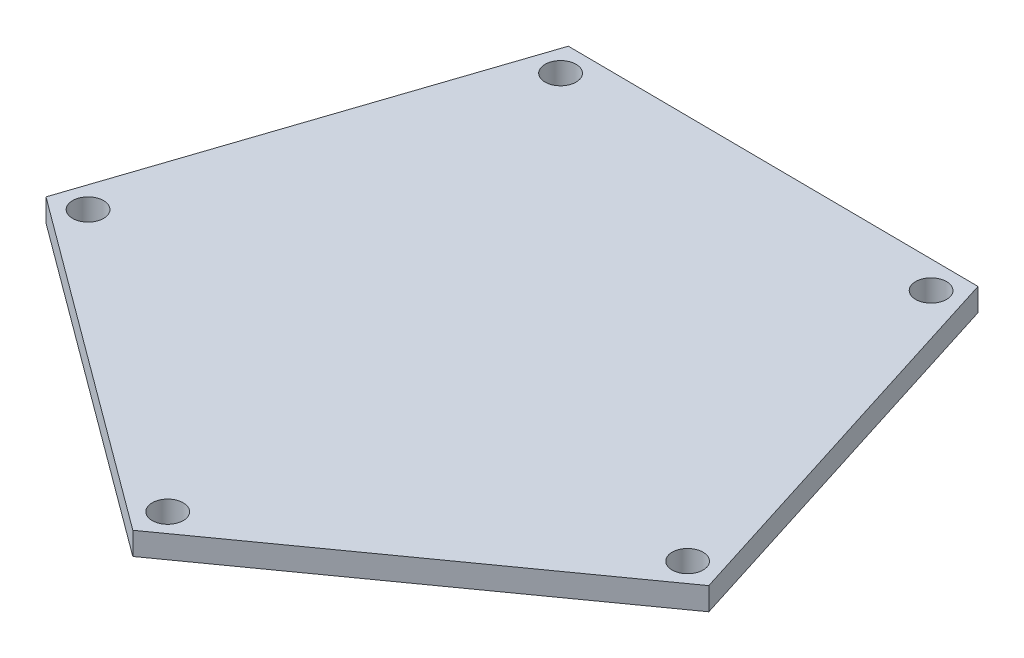
ISO-10303-21;
HEADER;
FILE_DESCRIPTION(('STEP AP214'),'2;1');
FILE_NAME('part.step','',(''),(''),'','','');
FILE_SCHEMA(('AUTOMOTIVE_DESIGN { 1 0 10303 214 1 1 1 1 }'));
ENDSEC;
DATA;
#1=APPLICATION_CONTEXT('core data for automotive mechanical design processes');
#2=APPLICATION_PROTOCOL_DEFINITION('international standard','automotive_design',2000,#1);
#3=PRODUCT_CONTEXT('',#1,'mechanical');
#4=PRODUCT('Part','Part','',(#3));
#5=PRODUCT_RELATED_PRODUCT_CATEGORY('part','',(#4));
#6=PRODUCT_DEFINITION_FORMATION('','',#4);
#7=PRODUCT_DEFINITION_CONTEXT('part definition',#1,'design');
#8=PRODUCT_DEFINITION('design','',#6,#7);
#9=PRODUCT_DEFINITION_SHAPE('','',#8);
#10=(LENGTH_UNIT() NAMED_UNIT(*) SI_UNIT(.MILLI.,.METRE.));
#11=(NAMED_UNIT(*) PLANE_ANGLE_UNIT() SI_UNIT($,.RADIAN.));
#12=(NAMED_UNIT(*) SI_UNIT($,.STERADIAN.) SOLID_ANGLE_UNIT());
#13=UNCERTAINTY_MEASURE_WITH_UNIT(LENGTH_MEASURE(1.E-05),#10,'distance_accuracy_value','');
#14=(GEOMETRIC_REPRESENTATION_CONTEXT(3) GLOBAL_UNCERTAINTY_ASSIGNED_CONTEXT((#13)) GLOBAL_UNIT_ASSIGNED_CONTEXT((#10,
#11,#12)) REPRESENTATION_CONTEXT('',''));
#15=CARTESIAN_POINT('',(0.,0.,0.));
#16=DIRECTION('',(0.,0.,1.));
#17=DIRECTION('',(1.,0.,0.));
#18=AXIS2_PLACEMENT_3D('',#15,#16,#17);
#19=CARTESIAN_POINT('',(0.,11.,0.));
#20=DIRECTION('',(0.,1.,0.));
#21=DIRECTION('',(0.,0.,1.));
#22=AXIS2_PLACEMENT_3D('',#19,#20,#21);
#23=PLANE('',#22);
#24=CARTESIAN_POINT('',(145.974464026982,11.,48.7010856094019));
#25=DIRECTION('',(0.,1.,0.));
#26=DIRECTION('',(0.,0.,1.));
#27=AXIS2_PLACEMENT_3D('',#24,#25,#26);
#28=CIRCLE('',#27,7.50000000000001);
#29=CARTESIAN_POINT('',(145.974464026982,11.,56.2010856094019));
#30=VERTEX_POINT('',#29);
#31=EDGE_CURVE('E179',#30,#30,#28,.T.);
#32=ORIENTED_EDGE('',*,*,#31,.F.);
#33=EDGE_LOOP('',(#32));
#34=FACE_BOUND('',#33,.T.);
#35=CARTESIAN_POINT('',(-146.717669584083,11.,46.4140615461807));
#36=DIRECTION('',(0.,1.,0.));
#37=DIRECTION('',(0.,0.,1.));
#38=AXIS2_PLACEMENT_3D('',#35,#36,#37);
#39=CIRCLE('',#38,7.50000000000001);
#40=CARTESIAN_POINT('',(-146.717669584083,11.,53.9140615461807));
#41=VERTEX_POINT('',#40);
#42=EDGE_CURVE('E191',#41,#41,#39,.T.);
#43=ORIENTED_EDGE('',*,*,#42,.F.);
#44=EDGE_LOOP('',(#43));
#45=FACE_BOUND('',#44,.T.);
#46=DIRECTION('',(0.813609596675983,0.,-0.581411579001265));
#47=VECTOR('',#46,1.);
#48=CARTESIAN_POINT('',(-1.33652109860429,11.,170.124911818793));
#49=LINE('',#48,#47);
#50=CARTESIAN_POINT('',(-1.33652109860429,11.,170.124911818793));
#51=VERTEX_POINT('',#50);
#52=CARTESIAN_POINT('',(161.385398236592,11.,53.84259601854));
#53=VERTEX_POINT('',#52);
#54=EDGE_CURVE('E120',#51,#53,#49,.T.);
#55=ORIENTED_EDGE('',*,*,#54,.T.);
#56=DIRECTION('',(-0.301536078699183,0.,-0.953454767276729));
#57=VECTOR('',#56,1.);
#58=CARTESIAN_POINT('',(161.385398236592,11.,53.84259601854));
#59=LINE('',#58,#57);
#60=CARTESIAN_POINT('',(101.078182496756,11.,-136.848357436806));
#61=VERTEX_POINT('',#60);
#62=EDGE_CURVE('E87',#53,#61,#59,.T.);
#63=ORIENTED_EDGE('',*,*,#62,.T.);
#64=DIRECTION('',(-0.999969142146441,0.,-0.00785587391137321));
#65=VECTOR('',#64,1.);
#66=CARTESIAN_POINT('',(101.078182496756,11.,-136.848357436806));
#67=LINE('',#66,#65);
#68=CARTESIAN_POINT('',(-98.9156459325325,11.,-138.41953221908));
#69=VERTEX_POINT('',#68);
#70=EDGE_CURVE('E91',#61,#69,#67,.T.);
#71=ORIENTED_EDGE('',*,*,#70,.T.);
#72=DIRECTION('',(-0.316478838848393,0.,0.948599570188166));
#73=VECTOR('',#72,1.);
#74=CARTESIAN_POINT('',(-98.9156459325325,11.,-138.41953221908));
#75=LINE('',#74,#73);
#76=CARTESIAN_POINT('',(-162.211413702211,11.,51.3003818185529));
#77=VERTEX_POINT('',#76);
#78=EDGE_CURVE('E95',#69,#77,#75,.T.);
#79=ORIENTED_EDGE('',*,*,#78,.T.);
#80=DIRECTION('',(0.804374463018033,0.,0.594122650001201));
#81=VECTOR('',#80,1.);
#82=CARTESIAN_POINT('',(-162.211413702211,11.,51.3003818185529));
#83=LINE('',#82,#81);
#84=EDGE_CURVE('E53',#77,#51,#83,.T.);
#85=ORIENTED_EDGE('',*,*,#84,.T.);
#86=EDGE_LOOP('',(#55,#63,#71,#79,#85));
#87=FACE_BOUND('',#86,.T.);
#88=CARTESIAN_POINT('',(-89.4700422507633,11.,-125.201643068873));
#89=DIRECTION('',(0.,1.,0.));
#90=DIRECTION('',(0.,0.,1.));
#91=AXIS2_PLACEMENT_3D('',#88,#89,#90);
#92=CIRCLE('',#91,7.50000000000003);
#93=CARTESIAN_POINT('',(-89.4700422507633,11.,-117.701643068873));
#94=VERTEX_POINT('',#93);
#95=EDGE_CURVE('E115',#94,#94,#92,.T.);
#96=ORIENTED_EDGE('',*,*,#95,.F.);
#97=EDGE_LOOP('',(#96));
#98=FACE_BOUND('',#97,.T.);
#99=CARTESIAN_POINT('',(-0.668260549302143,11.,153.881551932955));
#100=DIRECTION('',(0.,1.,0.));
#101=DIRECTION('',(0.,0.,1.));
#102=AXIS2_PLACEMENT_3D('',#99,#100,#101);
#103=CIRCLE('',#102,7.50000000000002);
#104=CARTESIAN_POINT('',(-0.668260549302143,11.,161.381551932955));
#105=VERTEX_POINT('',#104);
#106=EDGE_CURVE('E185',#105,#105,#103,.T.);
#107=ORIENTED_EDGE('',*,*,#106,.F.);
#108=EDGE_LOOP('',(#107));
#109=FACE_BOUND('',#108,.T.);
#110=CARTESIAN_POINT('',(91.4260749485817,11.,-123.780502127739));
#111=DIRECTION('',(0.,1.,0.));
#112=DIRECTION('',(0.,0.,1.));
#113=AXIS2_PLACEMENT_3D('',#110,#111,#112);
#114=CIRCLE('',#113,7.50000000000003);
#115=CARTESIAN_POINT('',(91.4260749485817,11.,-116.280502127739));
#116=VERTEX_POINT('',#115);
#117=EDGE_CURVE('E170',#116,#116,#114,.T.);
#118=ORIENTED_EDGE('',*,*,#117,.F.);
#119=EDGE_LOOP('',(#118));
#120=FACE_BOUND('',#119,.T.);
#121=ADVANCED_FACE('F36',(#34,#45,#87,#98,#109,#120),#23,.T.);
#122=CARTESIAN_POINT('',(0.,0.,0.));
#123=DIRECTION('',(0.,1.,0.));
#124=DIRECTION('',(0.,0.,1.));
#125=AXIS2_PLACEMENT_3D('',#122,#123,#124);
#126=PLANE('',#125);
#127=DIRECTION('',(0.813609596675983,0.,-0.581411579001265));
#128=VECTOR('',#127,1.);
#129=CARTESIAN_POINT('',(-1.33652109860429,0.,170.124911818793));
#130=LINE('',#129,#128);
#131=CARTESIAN_POINT('',(-1.33652109860429,0.,170.124911818793));
#132=VERTEX_POINT('',#131);
#133=CARTESIAN_POINT('',(161.385398236592,0.,53.84259601854));
#134=VERTEX_POINT('',#133);
#135=EDGE_CURVE('E111',#132,#134,#130,.T.);
#136=ORIENTED_EDGE('',*,*,#135,.F.);
#137=DIRECTION('',(0.804374463018033,0.,0.594122650001201));
#138=VECTOR('',#137,1.);
#139=CARTESIAN_POINT('',(-162.211413702211,0.,51.3003818185529));
#140=LINE('',#139,#138);
#141=CARTESIAN_POINT('',(-162.211413702211,0.,51.3003818185529));
#142=VERTEX_POINT('',#141);
#143=EDGE_CURVE('E79',#142,#132,#140,.T.);
#144=ORIENTED_EDGE('',*,*,#143,.F.);
#145=DIRECTION('',(-0.316478838848393,0.,0.948599570188166));
#146=VECTOR('',#145,1.);
#147=CARTESIAN_POINT('',(-98.9156459325325,0.,-138.41953221908));
#148=LINE('',#147,#146);
#149=CARTESIAN_POINT('',(-98.9156459325325,0.,-138.41953221908));
#150=VERTEX_POINT('',#149);
#151=EDGE_CURVE('E73',#150,#142,#148,.T.);
#152=ORIENTED_EDGE('',*,*,#151,.F.);
#153=DIRECTION('',(-0.999969142146441,0.,-0.00785587391137321));
#154=VECTOR('',#153,1.);
#155=CARTESIAN_POINT('',(101.078182496756,0.,-136.848357436806));
#156=LINE('',#155,#154);
#157=CARTESIAN_POINT('',(101.078182496756,0.,-136.848357436806));
#158=VERTEX_POINT('',#157);
#159=EDGE_CURVE('E102',#158,#150,#156,.T.);
#160=ORIENTED_EDGE('',*,*,#159,.F.);
#161=DIRECTION('',(-0.301536078699183,0.,-0.953454767276729));
#162=VECTOR('',#161,1.);
#163=CARTESIAN_POINT('',(161.385398236592,0.,53.84259601854));
#164=LINE('',#163,#162);
#165=EDGE_CURVE('E114',#134,#158,#164,.T.);
#166=ORIENTED_EDGE('',*,*,#165,.F.);
#167=EDGE_LOOP('',(#136,#144,#152,#160,#166));
#168=FACE_BOUND('',#167,.T.);
#169=CARTESIAN_POINT('',(-89.4700422507633,0.,-125.201643068873));
#170=DIRECTION('',(0.,1.,0.));
#171=DIRECTION('',(0.,0.,1.));
#172=AXIS2_PLACEMENT_3D('',#169,#170,#171);
#173=CIRCLE('',#172,7.50000000000003);
#174=CARTESIAN_POINT('',(-89.4700422507633,0.,-117.701643068873));
#175=VERTEX_POINT('',#174);
#176=EDGE_CURVE('E194',#175,#175,#173,.T.);
#177=ORIENTED_EDGE('',*,*,#176,.T.);
#178=EDGE_LOOP('',(#177));
#179=FACE_BOUND('',#178,.T.);
#180=CARTESIAN_POINT('',(-146.717669584083,0.,46.4140615461807));
#181=DIRECTION('',(0.,1.,0.));
#182=DIRECTION('',(0.,0.,1.));
#183=AXIS2_PLACEMENT_3D('',#180,#181,#182);
#184=CIRCLE('',#183,7.50000000000001);
#185=CARTESIAN_POINT('',(-146.717669584083,0.,53.9140615461807));
#186=VERTEX_POINT('',#185);
#187=EDGE_CURVE('E188',#186,#186,#184,.T.);
#188=ORIENTED_EDGE('',*,*,#187,.T.);
#189=EDGE_LOOP('',(#188));
#190=FACE_BOUND('',#189,.T.);
#191=CARTESIAN_POINT('',(-0.668260549302143,0.,153.881551932955));
#192=DIRECTION('',(0.,1.,0.));
#193=DIRECTION('',(0.,0.,1.));
#194=AXIS2_PLACEMENT_3D('',#191,#192,#193);
#195=CIRCLE('',#194,7.50000000000002);
#196=CARTESIAN_POINT('',(-0.668260549302143,0.,161.381551932955));
#197=VERTEX_POINT('',#196);
#198=EDGE_CURVE('E182',#197,#197,#195,.T.);
#199=ORIENTED_EDGE('',*,*,#198,.T.);
#200=EDGE_LOOP('',(#199));
#201=FACE_BOUND('',#200,.T.);
#202=CARTESIAN_POINT('',(145.974464026982,0.,48.7010856094019));
#203=DIRECTION('',(0.,1.,0.));
#204=DIRECTION('',(0.,0.,1.));
#205=AXIS2_PLACEMENT_3D('',#202,#203,#204);
#206=CIRCLE('',#205,7.50000000000001);
#207=CARTESIAN_POINT('',(145.974464026982,0.,56.2010856094019));
#208=VERTEX_POINT('',#207);
#209=EDGE_CURVE('E176',#208,#208,#206,.T.);
#210=ORIENTED_EDGE('',*,*,#209,.T.);
#211=EDGE_LOOP('',(#210));
#212=FACE_BOUND('',#211,.T.);
#213=CARTESIAN_POINT('',(91.4260749485817,0.,-123.780502127739));
#214=DIRECTION('',(0.,1.,0.));
#215=DIRECTION('',(0.,0.,1.));
#216=AXIS2_PLACEMENT_3D('',#213,#214,#215);
#217=CIRCLE('',#216,7.50000000000003);
#218=CARTESIAN_POINT('',(91.4260749485817,0.,-116.280502127739));
#219=VERTEX_POINT('',#218);
#220=EDGE_CURVE('E173',#219,#219,#217,.T.);
#221=ORIENTED_EDGE('',*,*,#220,.T.);
#222=EDGE_LOOP('',(#221));
#223=FACE_BOUND('',#222,.T.);
#224=ADVANCED_FACE('F124',(#168,#179,#190,#201,#212,#223),#126,.F.);
#225=CARTESIAN_POINT('',(-1.33652109860429,11.,170.124911818793));
#226=DIRECTION('',(-0.581411579001266,0.,-0.813609596675983));
#227=DIRECTION('',(-0.813609596675983,0.,0.581411579001266));
#228=AXIS2_PLACEMENT_3D('',#225,#226,#227);
#229=PLANE('',#228);
#230=ORIENTED_EDGE('',*,*,#135,.T.);
#231=DIRECTION('',(0.,-1.,0.));
#232=VECTOR('',#231,1.);
#233=CARTESIAN_POINT('',(161.385398236592,11.,53.84259601854));
#234=LINE('',#233,#232);
#235=EDGE_CURVE('E11',#53,#134,#234,.T.);
#236=ORIENTED_EDGE('',*,*,#235,.F.);
#237=ORIENTED_EDGE('',*,*,#54,.F.);
#238=DIRECTION('',(0.,-1.,0.));
#239=VECTOR('',#238,1.);
#240=CARTESIAN_POINT('',(-1.33652109860429,11.,170.124911818793));
#241=LINE('',#240,#239);
#242=EDGE_CURVE('E107',#51,#132,#241,.T.);
#243=ORIENTED_EDGE('',*,*,#242,.T.);
#244=EDGE_LOOP('',(#230,#236,#237,#243));
#245=FACE_BOUND('',#244,.T.);
#246=ADVANCED_FACE('F38',(#245),#229,.F.);
#247=CARTESIAN_POINT('',(161.385398236592,11.,53.84259601854));
#248=DIRECTION('',(-0.953454767276728,0.,0.301536078699183));
#249=DIRECTION('',(0.301536078699183,0.,0.953454767276728));
#250=AXIS2_PLACEMENT_3D('',#247,#248,#249);
#251=PLANE('',#250);
#252=ORIENTED_EDGE('',*,*,#165,.T.);
#253=DIRECTION('',(0.,-1.,0.));
#254=VECTOR('',#253,1.);
#255=CARTESIAN_POINT('',(101.078182496756,11.,-136.848357436806));
#256=LINE('',#255,#254);
#257=EDGE_CURVE('E45',#61,#158,#256,.T.);
#258=ORIENTED_EDGE('',*,*,#257,.F.);
#259=ORIENTED_EDGE('',*,*,#62,.F.);
#260=ORIENTED_EDGE('',*,*,#235,.T.);
#261=EDGE_LOOP('',(#252,#258,#259,#260));
#262=FACE_BOUND('',#261,.T.);
#263=ADVANCED_FACE('F252',(#262),#251,.F.);
#264=CARTESIAN_POINT('',(101.078182496756,11.,-136.848357436806));
#265=DIRECTION('',(-0.00785587391137321,0.,0.999969142146441));
#266=DIRECTION('',(0.999969142146441,0.,0.00785587391137321));
#267=AXIS2_PLACEMENT_3D('',#264,#265,#266);
#268=PLANE('',#267);
#269=ORIENTED_EDGE('',*,*,#159,.T.);
#270=DIRECTION('',(0.,-1.,0.));
#271=VECTOR('',#270,1.);
#272=CARTESIAN_POINT('',(-98.9156459325325,11.,-138.41953221908));
#273=LINE('',#272,#271);
#274=EDGE_CURVE('E99',#69,#150,#273,.T.);
#275=ORIENTED_EDGE('',*,*,#274,.F.);
#276=ORIENTED_EDGE('',*,*,#70,.F.);
#277=ORIENTED_EDGE('',*,*,#257,.T.);
#278=EDGE_LOOP('',(#269,#275,#276,#277));
#279=FACE_BOUND('',#278,.T.);
#280=ADVANCED_FACE('F100',(#279),#268,.F.);
#281=CARTESIAN_POINT('',(-98.9156459325325,11.,-138.41953221908));
#282=DIRECTION('',(0.948599570188166,0.,0.316478838848393));
#283=DIRECTION('',(0.316478838848393,0.,-0.948599570188166));
#284=AXIS2_PLACEMENT_3D('',#281,#282,#283);
#285=PLANE('',#284);
#286=ORIENTED_EDGE('',*,*,#151,.T.);
#287=DIRECTION('',(0.,-1.,0.));
#288=VECTOR('',#287,1.);
#289=CARTESIAN_POINT('',(-162.211413702211,11.,51.3003818185529));
#290=LINE('',#289,#288);
#291=EDGE_CURVE('E103',#77,#142,#290,.T.);
#292=ORIENTED_EDGE('',*,*,#291,.F.);
#293=ORIENTED_EDGE('',*,*,#78,.F.);
#294=ORIENTED_EDGE('',*,*,#274,.T.);
#295=EDGE_LOOP('',(#286,#292,#293,#294));
#296=FACE_BOUND('',#295,.T.);
#297=ADVANCED_FACE('F105',(#296),#285,.F.);
#298=CARTESIAN_POINT('',(-162.211413702211,11.,51.3003818185529));
#299=DIRECTION('',(0.594122650001202,0.,-0.804374463018034));
#300=DIRECTION('',(-0.804374463018034,0.,-0.594122650001202));
#301=AXIS2_PLACEMENT_3D('',#298,#299,#300);
#302=PLANE('',#301);
#303=ORIENTED_EDGE('',*,*,#143,.T.);
#304=ORIENTED_EDGE('',*,*,#242,.F.);
#305=ORIENTED_EDGE('',*,*,#84,.F.);
#306=ORIENTED_EDGE('',*,*,#291,.T.);
#307=EDGE_LOOP('',(#303,#304,#305,#306));
#308=FACE_BOUND('',#307,.T.);
#309=ADVANCED_FACE('F129',(#308),#302,.F.);
#310=CARTESIAN_POINT('',(-89.4700422507633,11.,-125.201643068873));
#311=DIRECTION('',(0.,-1.,0.));
#312=DIRECTION('',(0.,0.,-1.));
#313=AXIS2_PLACEMENT_3D('',#310,#311,#312);
#314=CYLINDRICAL_SURFACE('',#313,7.50000000000003);
#315=ORIENTED_EDGE('',*,*,#95,.T.);
#316=EDGE_LOOP('',(#315));
#317=FACE_BOUND('',#316,.T.);
#318=ORIENTED_EDGE('',*,*,#176,.F.);
#319=EDGE_LOOP('',(#318));
#320=FACE_BOUND('',#319,.T.);
#321=ADVANCED_FACE('F131',(#317,#320),#314,.F.);
#322=CARTESIAN_POINT('',(-146.717669584083,11.,46.4140615461807));
#323=DIRECTION('',(0.,-1.,0.));
#324=DIRECTION('',(0.,0.,-1.));
#325=AXIS2_PLACEMENT_3D('',#322,#323,#324);
#326=CYLINDRICAL_SURFACE('',#325,7.50000000000001);
#327=ORIENTED_EDGE('',*,*,#42,.T.);
#328=EDGE_LOOP('',(#327));
#329=FACE_BOUND('',#328,.T.);
#330=ORIENTED_EDGE('',*,*,#187,.F.);
#331=EDGE_LOOP('',(#330));
#332=FACE_BOUND('',#331,.T.);
#333=ADVANCED_FACE('F137',(#329,#332),#326,.F.);
#334=CARTESIAN_POINT('',(-0.668260549302143,11.,153.881551932955));
#335=DIRECTION('',(0.,-1.,0.));
#336=DIRECTION('',(0.,0.,-1.));
#337=AXIS2_PLACEMENT_3D('',#334,#335,#336);
#338=CYLINDRICAL_SURFACE('',#337,7.50000000000002);
#339=ORIENTED_EDGE('',*,*,#106,.T.);
#340=EDGE_LOOP('',(#339));
#341=FACE_BOUND('',#340,.T.);
#342=ORIENTED_EDGE('',*,*,#198,.F.);
#343=EDGE_LOOP('',(#342));
#344=FACE_BOUND('',#343,.T.);
#345=ADVANCED_FACE('F153',(#341,#344),#338,.F.);
#346=CARTESIAN_POINT('',(145.974464026982,11.,48.7010856094019));
#347=DIRECTION('',(0.,-1.,0.));
#348=DIRECTION('',(0.,0.,-1.));
#349=AXIS2_PLACEMENT_3D('',#346,#347,#348);
#350=CYLINDRICAL_SURFACE('',#349,7.50000000000001);
#351=ORIENTED_EDGE('',*,*,#31,.T.);
#352=EDGE_LOOP('',(#351));
#353=FACE_BOUND('',#352,.T.);
#354=ORIENTED_EDGE('',*,*,#209,.F.);
#355=EDGE_LOOP('',(#354));
#356=FACE_BOUND('',#355,.T.);
#357=ADVANCED_FACE('F157',(#353,#356),#350,.F.);
#358=CARTESIAN_POINT('',(91.4260749485817,11.,-123.780502127739));
#359=DIRECTION('',(0.,-1.,0.));
#360=DIRECTION('',(0.,0.,-1.));
#361=AXIS2_PLACEMENT_3D('',#358,#359,#360);
#362=CYLINDRICAL_SURFACE('',#361,7.50000000000003);
#363=ORIENTED_EDGE('',*,*,#117,.T.);
#364=EDGE_LOOP('',(#363));
#365=FACE_BOUND('',#364,.T.);
#366=ORIENTED_EDGE('',*,*,#220,.F.);
#367=EDGE_LOOP('',(#366));
#368=FACE_BOUND('',#367,.T.);
#369=ADVANCED_FACE('F161',(#365,#368),#362,.F.);
#370=CLOSED_SHELL('',(#121,#224,#246,#263,#280,#297,#309,#321,#333,#345,#357,#369));
#371=MANIFOLD_SOLID_BREP('B2',#370);
#372=ADVANCED_BREP_SHAPE_REPRESENTATION('',(#18,#371),#14);
#373=SHAPE_DEFINITION_REPRESENTATION(#9,#372);
ENDSEC;
END-ISO-10303-21;
